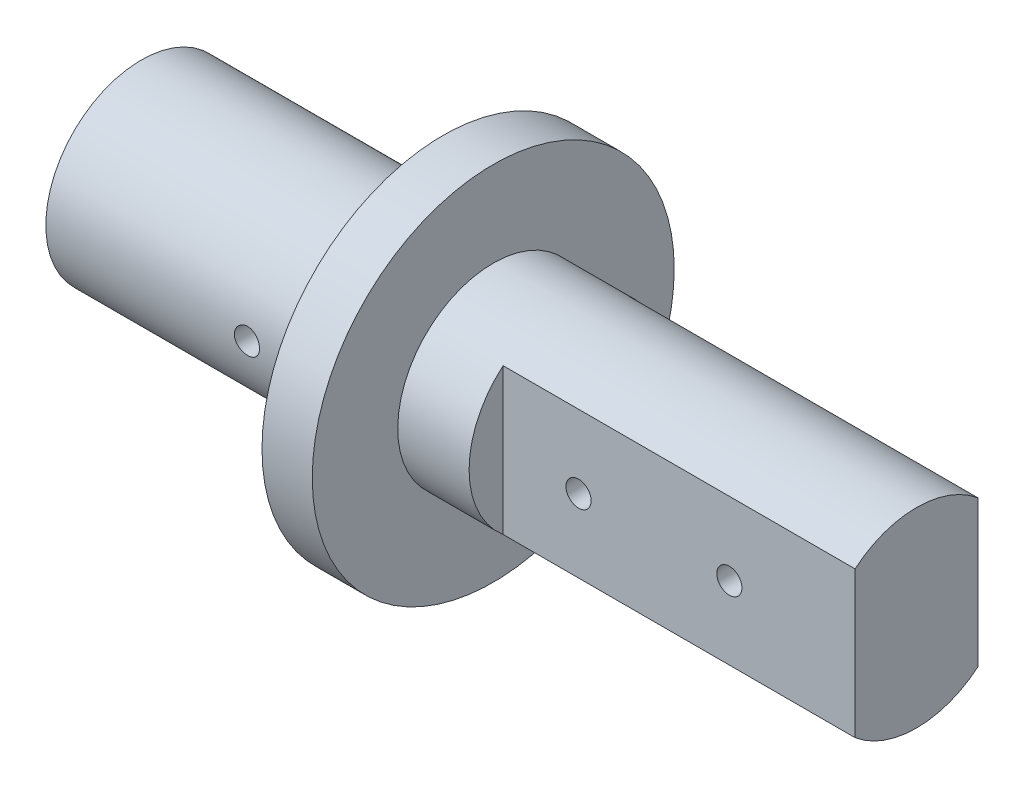
ISO-10303-21;
HEADER;
FILE_DESCRIPTION(('STEP AP214'),'2;1');
FILE_NAME('part.step','',(''),(''),'','','');
FILE_SCHEMA(('AUTOMOTIVE_DESIGN { 1 0 10303 214 1 1 1 1 }'));
ENDSEC;
DATA;
#1=APPLICATION_CONTEXT('core data for automotive mechanical design processes');
#2=APPLICATION_PROTOCOL_DEFINITION('international standard','automotive_design',2000,#1);
#3=PRODUCT_CONTEXT('',#1,'mechanical');
#4=PRODUCT('Part','Part','',(#3));
#5=PRODUCT_RELATED_PRODUCT_CATEGORY('part','',(#4));
#6=PRODUCT_DEFINITION_FORMATION('','',#4);
#7=PRODUCT_DEFINITION_CONTEXT('part definition',#1,'design');
#8=PRODUCT_DEFINITION('design','',#6,#7);
#9=PRODUCT_DEFINITION_SHAPE('','',#8);
#10=(LENGTH_UNIT() NAMED_UNIT(*) SI_UNIT(.MILLI.,.METRE.));
#11=(NAMED_UNIT(*) PLANE_ANGLE_UNIT() SI_UNIT($,.RADIAN.));
#12=(NAMED_UNIT(*) SI_UNIT($,.STERADIAN.) SOLID_ANGLE_UNIT());
#13=UNCERTAINTY_MEASURE_WITH_UNIT(LENGTH_MEASURE(1.E-05),#10,'distance_accuracy_value','');
#14=(GEOMETRIC_REPRESENTATION_CONTEXT(3) GLOBAL_UNCERTAINTY_ASSIGNED_CONTEXT((#13)) GLOBAL_UNIT_ASSIGNED_CONTEXT((#10,
#11,#12)) REPRESENTATION_CONTEXT('',''));
#15=CARTESIAN_POINT('',(0.,0.,0.));
#16=DIRECTION('',(0.,0.,1.));
#17=DIRECTION('',(1.,0.,0.));
#18=AXIS2_PLACEMENT_3D('',#15,#16,#17);
#19=CARTESIAN_POINT('',(0.,0.,0.));
#20=DIRECTION('',(-1.,0.,0.));
#21=DIRECTION('',(0.,0.,1.));
#22=AXIS2_PLACEMENT_3D('',#19,#20,#21);
#23=CYLINDRICAL_SURFACE('',#22,9.5);
#24=CARTESIAN_POINT('',(18.7571862711397,-0.133843323913922,9.49905710924214));
#25=CARTESIAN_POINT('',(18.7497191225898,-0.0644792715354372,9.50003343309708));
#26=CARTESIAN_POINT('',(18.7480669160832,0.00556405323647919,9.50025344602568));
#27=CARTESIAN_POINT('',(18.7564698736311,0.144979561522329,9.4991501404317));
#28=CARTESIAN_POINT('',(18.766536582819,0.214351015191011,9.49782529996253));
#29=CARTESIAN_POINT('',(18.7980796029942,0.350366331225342,9.49378059106666));
#30=CARTESIAN_POINT('',(18.8195490331772,0.417011812445685,9.49106156397555));
#31=CARTESIAN_POINT('',(18.8732622691699,0.545734422655254,9.48453117210074));
#32=CARTESIAN_POINT('',(18.9055043688729,0.607812273138289,9.48071998030071));
#33=CARTESIAN_POINT('',(18.980012367083,0.725964552348348,9.47240745265404));
#34=CARTESIAN_POINT('',(19.0223221240447,0.782011109915849,9.46790312848224));
#35=CARTESIAN_POINT('',(19.1157064001351,0.886240137139336,9.45871669072787));
#36=CARTESIAN_POINT('',(19.1667815153281,0.934422071547889,9.45403456507126));
#37=CARTESIAN_POINT('',(19.276627488953,1.02185619495898,9.44498592507392));
#38=CARTESIAN_POINT('',(19.3354441844691,1.06105105031087,9.44062155209812));
#39=CARTESIAN_POINT('',(19.4588782560648,1.12900411397511,9.43273687670716));
#40=CARTESIAN_POINT('',(19.5234955036514,1.15776255340239,9.42921655560101));
#41=CARTESIAN_POINT('',(19.6564987756165,1.20392977740594,9.42343337261771));
#42=CARTESIAN_POINT('',(19.7248727157887,1.22137287959152,9.4211667117012));
#43=CARTESIAN_POINT('',(19.8636103529643,1.24452529660299,9.41813651838227));
#44=CARTESIAN_POINT('',(19.9339739399041,1.25023525920218,9.41737290299852));
#45=CARTESIAN_POINT('',(20.0741180473625,1.2497517017472,9.41743702976489));
#46=CARTESIAN_POINT('',(20.1438989048636,1.24364904358161,9.41825262474987));
#47=CARTESIAN_POINT('',(20.2814336529233,1.21990371925658,9.42135745067241));
#48=CARTESIAN_POINT('',(20.3491875416964,1.20226104293217,9.42364668290801));
#49=CARTESIAN_POINT('',(20.480743116948,1.15596182651778,9.42943754488172));
#50=CARTESIAN_POINT('',(20.5445458358198,1.12730817768202,9.43293885632892));
#51=CARTESIAN_POINT('',(20.6664552359945,1.05980782384128,9.44076039951871));
#52=CARTESIAN_POINT('',(20.7245616357526,1.02096061536062,9.4450806717081));
#53=CARTESIAN_POINT('',(20.8338984806609,0.933828974038488,9.45409385220929));
#54=CARTESIAN_POINT('',(20.885073778255,0.885475593717308,9.45878932455992));
#55=CARTESIAN_POINT('',(20.9786065215152,0.780866430075416,9.4679986824394));
#56=CARTESIAN_POINT('',(21.0209637465793,0.724610449113877,9.47251256342309));
#57=CARTESIAN_POINT('',(21.0958030235709,0.605539355360445,9.48086976017443));
#58=CARTESIAN_POINT('',(21.1282487731954,0.542701236249752,9.48471058940574));
#59=CARTESIAN_POINT('',(21.1821115457805,0.412408807957424,9.49126803634612));
#60=CARTESIAN_POINT('',(21.203529026196,0.344954690379857,9.49398470068487));
#61=CARTESIAN_POINT('',(21.2346061809182,0.207763032854201,9.49797421108078));
#62=CARTESIAN_POINT('',(21.2443337745644,0.138041124441231,9.4992553944454));
#63=CARTESIAN_POINT('',(21.2519651241998,-0.00205653685352284,9.50025797279816));
#64=CARTESIAN_POINT('',(21.249869366228,-0.0724322627391881,9.49997943190406));
#65=CARTESIAN_POINT('',(21.2339681065827,-0.211383856020531,9.49790067530691));
#66=CARTESIAN_POINT('',(21.2202346292857,-0.279968125199801,9.49610981936629));
#67=CARTESIAN_POINT('',(21.1815597652179,-0.413850068958151,9.49121796297753));
#68=CARTESIAN_POINT('',(21.1566181539444,-0.479147677675186,9.48811693628631));
#69=CARTESIAN_POINT('',(21.096156312494,-0.604829835387539,9.48093661981255));
#70=CARTESIAN_POINT('',(21.0606043437987,-0.665198941952211,9.47685440224967));
#71=CARTESIAN_POINT('',(20.9799543620407,-0.779141796266092,9.46816815868444));
#72=CARTESIAN_POINT('',(20.9348558578671,-0.832715194190853,9.46356410584252));
#73=CARTESIAN_POINT('',(20.8359870238673,-0.931970546159648,9.45430798542196));
#74=CARTESIAN_POINT('',(20.7821536989094,-0.9775897640859,9.44965581802707));
#75=CARTESIAN_POINT('',(20.6675606826757,-1.05915474905901,9.44086222125012));
#76=CARTESIAN_POINT('',(20.6068009758146,-1.09510049433848,9.43672079301734));
#77=CARTESIAN_POINT('',(20.4800260933277,-1.15630060773529,9.42941800330284));
#78=CARTESIAN_POINT('',(20.4140086301521,-1.18155029167616,9.42625707137639));
#79=CARTESIAN_POINT('',(20.2786196091799,-1.22058753162685,9.42128212839032));
#80=CARTESIAN_POINT('',(20.2092482258022,-1.23437568301045,9.41946804736853));
#81=CARTESIAN_POINT('',(20.0696770146042,-1.25001578901799,9.41740533972257));
#82=CARTESIAN_POINT('',(19.9994872830052,-1.25195636866387,9.41714509008395));
#83=CARTESIAN_POINT('',(19.8597839001592,-1.24407956860155,9.4181888493365));
#84=CARTESIAN_POINT('',(19.7902702339264,-1.23426245012179,9.41949282347429));
#85=CARTESIAN_POINT('',(19.6541538459982,-1.20322302888803,9.42350758955671));
#86=CARTESIAN_POINT('',(19.587541324056,-1.1820429706235,9.42621316941837));
#87=CARTESIAN_POINT('',(19.4588147107473,-1.12892288538793,9.43272202907677));
#88=CARTESIAN_POINT('',(19.3967006531188,-1.09698277772767,9.43652531710514));
#89=CARTESIAN_POINT('',(19.2783359388641,-1.02303423463727,9.4448286559659));
#90=CARTESIAN_POINT('',(19.2221213242369,-0.980968558751438,9.4493326146031));
#91=CARTESIAN_POINT('',(19.1175063990004,-0.888032217775664,9.45851856141931));
#92=CARTESIAN_POINT('',(19.0691080485902,-0.837159350584597,9.46320059389391));
#93=CARTESIAN_POINT('',(18.9811880300445,-0.72765848566234,9.47225147965771));
#94=CARTESIAN_POINT('',(18.9417281493417,-0.668980707507695,9.47661801890231));
#95=CARTESIAN_POINT('',(18.8732619564631,-0.545816303637497,9.48450716558606));
#96=CARTESIAN_POINT('',(18.8442446968534,-0.481335850307806,9.48803065552202));
#97=CARTESIAN_POINT('',(18.804886095254,-0.369491516358376,9.49292106017614));
#98=CARTESIAN_POINT('',(18.7915404773749,-0.323175076086507,9.49461755714822));
#99=CARTESIAN_POINT('',(18.7702681725671,-0.229294778749665,9.49734856170854));
#100=CARTESIAN_POINT('',(18.762341446779,-0.181730930632482,9.49838307404391));
#101=CARTESIAN_POINT('',(18.7571862711397,-0.133843323913922,9.49905710924214));
#102=B_SPLINE_CURVE_WITH_KNOTS('',3,(#24,#25,#26,#27,#28,#29,#30,#31,#32,#33,#34,#35,#36,#37,
#38,#39,#40,#41,#42,#43,#44,#45,#46,#47,#48,#49,#50,#51,#52,#53,#54,#55,#56,#57,#58,#59,#60,#61,
#62,#63,#64,#65,#66,#67,#68,#69,#70,#71,#72,#73,#74,#75,#76,#77,#78,#79,#80,#81,#82,#83,#84,#85,
#86,#87,#88,#89,#90,#91,#92,#93,#94,#95,#96,#97,#98,#99,#100,#101),.UNSPECIFIED.,.T.,.F.,(4,2,2,
2,2,2,2,2,2,2,2,2,2,2,2,2,2,2,2,2,2,2,2,2,2,2,2,2,2,2,2,2,2,2,2,2,2,2,4),(0.,0.209139655009107,
0.418485522785862,0.627705207165943,0.836891772359222,1.04700687661839,1.25713627485178,
1.4685710582632,1.68000115915521,1.8907869907077,2.10156118470126,2.31072055855557,
2.51988011664733,2.72898479124065,2.93809979578234,3.14879151172392,3.35948849791804,
3.57094818879147,3.78239910756716,3.9926154431566,4.20282313715398,4.41173930435003,
4.62065965639331,4.83021131987617,5.03977376613028,5.25092086306614,5.46206843512397,
5.67330838067465,5.88453735259802,6.09418428390281,6.30382655743177,6.51269478176198,
6.721564572422,6.93164405516653,7.14177614108067,7.35331922359407,7.56463988619237,
7.70902691413943,7.85341290666598),.UNSPECIFIED.);
#103=CARTESIAN_POINT('',(18.7571862711397,-0.133843323913922,9.49905710924214));
#104=VERTEX_POINT('',#103);
#105=EDGE_CURVE('E12',#104,#104,#102,.T.);
#106=ORIENTED_EDGE('',*,*,#105,.T.);
#107=EDGE_LOOP('',(#106));
#108=FACE_BOUND('',#107,.T.);
#109=CARTESIAN_POINT('',(0.,0.,0.));
#110=DIRECTION('',(1.,0.,0.));
#111=DIRECTION('',(0.,0.,-1.));
#112=AXIS2_PLACEMENT_3D('',#109,#110,#111);
#113=CIRCLE('',#112,9.5);
#114=CARTESIAN_POINT('',(0.,0.,-9.5));
#115=VERTEX_POINT('',#114);
#116=EDGE_CURVE('E173',#115,#115,#113,.F.);
#117=ORIENTED_EDGE('',*,*,#116,.F.);
#118=EDGE_LOOP('',(#117));
#119=FACE_BOUND('',#118,.T.);
#120=CARTESIAN_POINT('',(30.,0.,0.));
#121=DIRECTION('',(1.,0.,0.));
#122=DIRECTION('',(0.,0.,-1.));
#123=AXIS2_PLACEMENT_3D('',#120,#121,#122);
#124=CIRCLE('',#123,9.5);
#125=CARTESIAN_POINT('',(30.,0.,-9.5));
#126=VERTEX_POINT('',#125);
#127=EDGE_CURVE('E50',#126,#126,#124,.T.);
#128=ORIENTED_EDGE('',*,*,#127,.F.);
#129=EDGE_LOOP('',(#128));
#130=FACE_BOUND('',#129,.T.);
#131=ADVANCED_FACE('F46',(#108,#119,#130),#23,.T.);
#132=CARTESIAN_POINT('',(0.,0.,0.));
#133=DIRECTION('',(1.,0.,0.));
#134=DIRECTION('',(0.,0.,-1.));
#135=AXIS2_PLACEMENT_3D('',#132,#133,#134);
#136=PLANE('',#135);
#137=ORIENTED_EDGE('',*,*,#116,.T.);
#138=EDGE_LOOP('',(#137));
#139=FACE_BOUND('',#138,.T.);
#140=ADVANCED_FACE('F209',(#139),#136,.F.);
#141=CARTESIAN_POINT('',(30.,0.,0.));
#142=DIRECTION('',(1.,0.,0.));
#143=DIRECTION('',(0.,0.,-1.));
#144=AXIS2_PLACEMENT_3D('',#141,#142,#143);
#145=CYLINDRICAL_SURFACE('',#144,18.);
#146=CARTESIAN_POINT('',(30.,0.,0.));
#147=DIRECTION('',(1.,0.,0.));
#148=DIRECTION('',(0.,0.,-1.));
#149=AXIS2_PLACEMENT_3D('',#146,#147,#148);
#150=CIRCLE('',#149,18.);
#151=CARTESIAN_POINT('',(30.,0.,-18.));
#152=VERTEX_POINT('',#151);
#153=EDGE_CURVE('E137',#152,#152,#150,.T.);
#154=ORIENTED_EDGE('',*,*,#153,.T.);
#155=EDGE_LOOP('',(#154));
#156=FACE_BOUND('',#155,.T.);
#157=CARTESIAN_POINT('',(35.,0.,0.));
#158=DIRECTION('',(1.,0.,0.));
#159=DIRECTION('',(0.,0.,-1.));
#160=AXIS2_PLACEMENT_3D('',#157,#158,#159);
#161=CIRCLE('',#160,18.);
#162=CARTESIAN_POINT('',(35.,0.,-18.));
#163=VERTEX_POINT('',#162);
#164=EDGE_CURVE('E136',#163,#163,#161,.T.);
#165=ORIENTED_EDGE('',*,*,#164,.F.);
#166=EDGE_LOOP('',(#165));
#167=FACE_BOUND('',#166,.T.);
#168=ADVANCED_FACE('F201',(#156,#167),#145,.T.);
#169=CARTESIAN_POINT('',(30.,0.,0.));
#170=DIRECTION('',(1.,0.,0.));
#171=DIRECTION('',(0.,0.,-1.));
#172=AXIS2_PLACEMENT_3D('',#169,#170,#171);
#173=PLANE('',#172);
#174=ORIENTED_EDGE('',*,*,#127,.T.);
#175=EDGE_LOOP('',(#174));
#176=FACE_BOUND('',#175,.T.);
#177=ORIENTED_EDGE('',*,*,#153,.F.);
#178=EDGE_LOOP('',(#177));
#179=FACE_BOUND('',#178,.T.);
#180=ADVANCED_FACE('F197',(#176,#179),#173,.F.);
#181=CARTESIAN_POINT('',(35.,0.,0.));
#182=DIRECTION('',(1.,0.,0.));
#183=DIRECTION('',(0.,0.,-1.));
#184=AXIS2_PLACEMENT_3D('',#181,#182,#183);
#185=PLANE('',#184);
#186=CARTESIAN_POINT('',(35.,0.,0.));
#187=DIRECTION('',(1.,0.,0.));
#188=DIRECTION('',(0.,0.,-1.));
#189=AXIS2_PLACEMENT_3D('',#186,#187,#188);
#190=CIRCLE('',#189,9.5);
#191=CARTESIAN_POINT('',(35.,0.,-9.5));
#192=VERTEX_POINT('',#191);
#193=EDGE_CURVE('E140',#192,#192,#190,.T.);
#194=ORIENTED_EDGE('',*,*,#193,.F.);
#195=EDGE_LOOP('',(#194));
#196=FACE_BOUND('',#195,.T.);
#197=ORIENTED_EDGE('',*,*,#164,.T.);
#198=EDGE_LOOP('',(#197));
#199=FACE_BOUND('',#198,.T.);
#200=ADVANCED_FACE('F200',(#196,#199),#185,.T.);
#201=CARTESIAN_POINT('',(42.1,10.,0.));
#202=DIRECTION('',(-1.,0.,0.));
#203=DIRECTION('',(0.,0.,1.));
#204=AXIS2_PLACEMENT_3D('',#201,#202,#203);
#205=PLANE('',#204);
#206=DIRECTION('',(0.,1.,0.));
#207=VECTOR('',#206,1.);
#208=CARTESIAN_POINT('',(42.1,10.,-6.11437827766147));
#209=LINE('',#208,#207);
#210=CARTESIAN_POINT('',(42.1,-7.27078938476845,-6.11437827766147));
#211=VERTEX_POINT('',#210);
#212=CARTESIAN_POINT('',(42.1,7.27078938476845,-6.11437827766147));
#213=VERTEX_POINT('',#212);
#214=EDGE_CURVE('E158',#211,#213,#209,.T.);
#215=ORIENTED_EDGE('',*,*,#214,.F.);
#216=CARTESIAN_POINT('',(42.1,0.,0.));
#217=DIRECTION('',(-1.,0.,0.));
#218=DIRECTION('',(0.,0.,1.));
#219=AXIS2_PLACEMENT_3D('',#216,#217,#218);
#220=CIRCLE('',#219,9.5);
#221=EDGE_CURVE('E87',#213,#211,#220,.T.);
#222=ORIENTED_EDGE('',*,*,#221,.F.);
#223=EDGE_LOOP('',(#215,#222));
#224=FACE_BOUND('',#223,.T.);
#225=ADVANCED_FACE('F205',(#224),#205,.F.);
#226=CARTESIAN_POINT('',(72.1,-7.5,-6.11437827766147));
#227=DIRECTION('',(0.,0.,1.));
#228=DIRECTION('',(1.,0.,0.));
#229=AXIS2_PLACEMENT_3D('',#226,#227,#228);
#230=PLANE('',#229);
#231=CARTESIAN_POINT('',(64.6,0.,-6.11437827766147));
#232=DIRECTION('',(0.,0.,1.));
#233=DIRECTION('',(1.,0.,0.));
#234=AXIS2_PLACEMENT_3D('',#231,#232,#233);
#235=CIRCLE('',#234,1.24999999999999);
#236=CARTESIAN_POINT('',(65.85,0.,-6.11437827766147));
#237=VERTEX_POINT('',#236);
#238=EDGE_CURVE('E125',#237,#237,#235,.F.);
#239=ORIENTED_EDGE('',*,*,#238,.F.);
#240=EDGE_LOOP('',(#239));
#241=FACE_BOUND('',#240,.T.);
#242=CARTESIAN_POINT('',(49.6,0.,-6.11437827766147));
#243=DIRECTION('',(0.,0.,1.));
#244=DIRECTION('',(1.,0.,0.));
#245=AXIS2_PLACEMENT_3D('',#242,#243,#244);
#246=CIRCLE('',#245,1.24999999999999);
#247=CARTESIAN_POINT('',(50.85,0.,-6.11437827766147));
#248=VERTEX_POINT('',#247);
#249=EDGE_CURVE('E129',#248,#248,#246,.F.);
#250=ORIENTED_EDGE('',*,*,#249,.F.);
#251=EDGE_LOOP('',(#250));
#252=FACE_BOUND('',#251,.T.);
#253=ORIENTED_EDGE('',*,*,#214,.T.);
#254=DIRECTION('',(-1.,0.,0.));
#255=VECTOR('',#254,1.);
#256=CARTESIAN_POINT('',(77.1,7.27078938476845,-6.11437827766147));
#257=LINE('',#256,#255);
#258=CARTESIAN_POINT('',(77.1,7.27078938476845,-6.11437827766147));
#259=VERTEX_POINT('',#258);
#260=EDGE_CURVE('E146',#259,#213,#257,.T.);
#261=ORIENTED_EDGE('',*,*,#260,.F.);
#262=DIRECTION('',(0.,1.,0.));
#263=VECTOR('',#262,1.);
#264=CARTESIAN_POINT('',(77.1,-7.5,-6.11437827766147));
#265=LINE('',#264,#263);
#266=CARTESIAN_POINT('',(77.1,-7.27078938476845,-6.11437827766147));
#267=VERTEX_POINT('',#266);
#268=EDGE_CURVE('E164',#267,#259,#265,.T.);
#269=ORIENTED_EDGE('',*,*,#268,.F.);
#270=DIRECTION('',(-1.,0.,0.));
#271=VECTOR('',#270,1.);
#272=CARTESIAN_POINT('',(77.1,-7.27078938476845,-6.11437827766147));
#273=LINE('',#272,#271);
#274=EDGE_CURVE('E150',#267,#211,#273,.T.);
#275=ORIENTED_EDGE('',*,*,#274,.T.);
#276=EDGE_LOOP('',(#253,#261,#269,#275));
#277=FACE_BOUND('',#276,.T.);
#278=ADVANCED_FACE('F246',(#241,#252,#277),#230,.F.);
#279=CARTESIAN_POINT('',(72.1,-7.5,6.11437827766147));
#280=DIRECTION('',(0.,0.,-1.));
#281=DIRECTION('',(-1.,0.,0.));
#282=AXIS2_PLACEMENT_3D('',#279,#280,#281);
#283=PLANE('',#282);
#284=CARTESIAN_POINT('',(49.6,0.,6.11437827766147));
#285=DIRECTION('',(0.,0.,-1.));
#286=DIRECTION('',(-1.,0.,0.));
#287=AXIS2_PLACEMENT_3D('',#284,#285,#286);
#288=CIRCLE('',#287,1.24999999999999);
#289=CARTESIAN_POINT('',(48.35,0.,6.11437827766147));
#290=VERTEX_POINT('',#289);
#291=EDGE_CURVE('E114',#290,#290,#288,.F.);
#292=ORIENTED_EDGE('',*,*,#291,.F.);
#293=EDGE_LOOP('',(#292));
#294=FACE_BOUND('',#293,.T.);
#295=CARTESIAN_POINT('',(64.6,0.,6.11437827766147));
#296=DIRECTION('',(0.,0.,-1.));
#297=DIRECTION('',(-1.,0.,0.));
#298=AXIS2_PLACEMENT_3D('',#295,#296,#297);
#299=CIRCLE('',#298,1.24999999999999);
#300=CARTESIAN_POINT('',(63.35,0.,6.11437827766147));
#301=VERTEX_POINT('',#300);
#302=EDGE_CURVE('E113',#301,#301,#299,.F.);
#303=ORIENTED_EDGE('',*,*,#302,.F.);
#304=EDGE_LOOP('',(#303));
#305=FACE_BOUND('',#304,.T.);
#306=DIRECTION('',(0.,-1.,0.));
#307=VECTOR('',#306,1.);
#308=CARTESIAN_POINT('',(42.1,10.,6.11437827766147));
#309=LINE('',#308,#307);
#310=CARTESIAN_POINT('',(42.1,7.27078938476845,6.11437827766147));
#311=VERTEX_POINT('',#310);
#312=CARTESIAN_POINT('',(42.1,-7.27078938476845,6.11437827766147));
#313=VERTEX_POINT('',#312);
#314=EDGE_CURVE('E155',#311,#313,#309,.T.);
#315=ORIENTED_EDGE('',*,*,#314,.T.);
#316=DIRECTION('',(-1.,0.,0.));
#317=VECTOR('',#316,1.);
#318=CARTESIAN_POINT('',(77.1,-7.27078938476845,6.11437827766147));
#319=LINE('',#318,#317);
#320=CARTESIAN_POINT('',(77.1,-7.27078938476845,6.11437827766147));
#321=VERTEX_POINT('',#320);
#322=EDGE_CURVE('E147',#321,#313,#319,.T.);
#323=ORIENTED_EDGE('',*,*,#322,.F.);
#324=DIRECTION('',(0.,-1.,0.));
#325=VECTOR('',#324,1.);
#326=CARTESIAN_POINT('',(77.1,-7.5,6.11437827766147));
#327=LINE('',#326,#325);
#328=CARTESIAN_POINT('',(77.1,7.27078938476845,6.11437827766147));
#329=VERTEX_POINT('',#328);
#330=EDGE_CURVE('E120',#329,#321,#327,.T.);
#331=ORIENTED_EDGE('',*,*,#330,.F.);
#332=DIRECTION('',(-1.,0.,0.));
#333=VECTOR('',#332,1.);
#334=CARTESIAN_POINT('',(77.1,7.27078938476845,6.11437827766147));
#335=LINE('',#334,#333);
#336=EDGE_CURVE('E143',#329,#311,#335,.T.);
#337=ORIENTED_EDGE('',*,*,#336,.T.);
#338=EDGE_LOOP('',(#315,#323,#331,#337));
#339=FACE_BOUND('',#338,.T.);
#340=ADVANCED_FACE('F48',(#294,#305,#339),#283,.F.);
#341=ORIENTED_EDGE('',*,*,#314,.F.);
#342=CARTESIAN_POINT('',(42.1,0.,0.));
#343=DIRECTION('',(-1.,0.,0.));
#344=DIRECTION('',(0.,0.,1.));
#345=AXIS2_PLACEMENT_3D('',#342,#343,#344);
#346=CIRCLE('',#345,9.5);
#347=EDGE_CURVE('E62',#313,#311,#346,.T.);
#348=ORIENTED_EDGE('',*,*,#347,.F.);
#349=EDGE_LOOP('',(#341,#348));
#350=FACE_BOUND('',#349,.T.);
#351=ADVANCED_FACE('F211',(#350),#205,.F.);
#352=ORIENTED_EDGE('',*,*,#193,.T.);
#353=EDGE_LOOP('',(#352));
#354=FACE_BOUND('',#353,.T.);
#355=ORIENTED_EDGE('',*,*,#347,.T.);
#356=ORIENTED_EDGE('',*,*,#336,.F.);
#357=CARTESIAN_POINT('',(77.1,0.,0.));
#358=DIRECTION('',(1.,0.,0.));
#359=DIRECTION('',(0.,0.,-1.));
#360=AXIS2_PLACEMENT_3D('',#357,#358,#359);
#361=CIRCLE('',#360,9.5);
#362=EDGE_CURVE('E161',#259,#329,#361,.T.);
#363=ORIENTED_EDGE('',*,*,#362,.F.);
#364=ORIENTED_EDGE('',*,*,#260,.T.);
#365=ORIENTED_EDGE('',*,*,#221,.T.);
#366=ORIENTED_EDGE('',*,*,#274,.F.);
#367=CARTESIAN_POINT('',(77.1,0.,0.));
#368=DIRECTION('',(1.,0.,0.));
#369=DIRECTION('',(0.,0.,-1.));
#370=AXIS2_PLACEMENT_3D('',#367,#368,#369);
#371=CIRCLE('',#370,9.5);
#372=EDGE_CURVE('E167',#321,#267,#371,.T.);
#373=ORIENTED_EDGE('',*,*,#372,.F.);
#374=ORIENTED_EDGE('',*,*,#322,.T.);
#375=EDGE_LOOP('',(#355,#356,#363,#364,#365,#366,#373,#374));
#376=FACE_BOUND('',#375,.T.);
#377=ADVANCED_FACE('F183',(#354,#376),#23,.T.);
#378=CARTESIAN_POINT('',(20.,0.,10.));
#379=DIRECTION('',(0.,0.,1.));
#380=DIRECTION('',(1.,0.,0.));
#381=AXIS2_PLACEMENT_3D('',#378,#379,#380);
#382=CYLINDRICAL_SURFACE('',#381,1.24999999999999);
#383=CARTESIAN_POINT('',(20.,0.,0.));
#384=DIRECTION('',(0.,0.,1.));
#385=DIRECTION('',(1.,0.,0.));
#386=AXIS2_PLACEMENT_3D('',#383,#384,#385);
#387=CIRCLE('',#386,1.25);
#388=CARTESIAN_POINT('',(21.25,0.,0.));
#389=VERTEX_POINT('',#388);
#390=EDGE_CURVE('E133',#389,#389,#387,.T.);
#391=ORIENTED_EDGE('',*,*,#390,.F.);
#392=EDGE_LOOP('',(#391));
#393=FACE_BOUND('',#392,.T.);
#394=ORIENTED_EDGE('',*,*,#105,.F.);
#395=EDGE_LOOP('',(#394));
#396=FACE_BOUND('',#395,.T.);
#397=ADVANCED_FACE('F186',(#393,#396),#382,.F.);
#398=CARTESIAN_POINT('',(20.,0.,0.));
#399=DIRECTION('',(0.,0.,1.));
#400=DIRECTION('',(1.,0.,0.));
#401=AXIS2_PLACEMENT_3D('',#398,#399,#400);
#402=CONICAL_SURFACE('',#401,1.25,1.02974425867665);
#403=CARTESIAN_POINT('',(20.,0.,-0.751075773784452));
#404=VERTEX_POINT('',#403);
#405=VERTEX_LOOP('',#404);
#406=FACE_BOUND('',#405,.T.);
#407=ORIENTED_EDGE('',*,*,#390,.T.);
#408=EDGE_LOOP('',(#407));
#409=FACE_BOUND('',#408,.T.);
#410=ADVANCED_FACE('F191',(#406,#409),#402,.F.);
#411=CARTESIAN_POINT('',(49.6,0.,-1.61437827766148));
#412=DIRECTION('',(0.,0.,-1.));
#413=DIRECTION('',(-1.,0.,0.));
#414=AXIS2_PLACEMENT_3D('',#411,#412,#413);
#415=CONICAL_SURFACE('',#414,1.25,1.02974425867665);
#416=CARTESIAN_POINT('',(49.6,0.,-0.863302503877024));
#417=VERTEX_POINT('',#416);
#418=VERTEX_LOOP('',#417);
#419=FACE_BOUND('',#418,.T.);
#420=CARTESIAN_POINT('',(49.6,0.,-1.61437827766148));
#421=DIRECTION('',(0.,0.,-1.));
#422=DIRECTION('',(-1.,0.,0.));
#423=AXIS2_PLACEMENT_3D('',#420,#421,#422);
#424=CIRCLE('',#423,1.25);
#425=CARTESIAN_POINT('',(48.35,0.,-1.61437827766148));
#426=VERTEX_POINT('',#425);
#427=EDGE_CURVE('E130',#426,#426,#424,.T.);
#428=ORIENTED_EDGE('',*,*,#427,.T.);
#429=EDGE_LOOP('',(#428));
#430=FACE_BOUND('',#429,.T.);
#431=ADVANCED_FACE('F193',(#419,#430),#415,.F.);
#432=CARTESIAN_POINT('',(49.6,0.,-6.61437827766147));
#433=DIRECTION('',(0.,0.,-1.));
#434=DIRECTION('',(-1.,0.,0.));
#435=AXIS2_PLACEMENT_3D('',#432,#433,#434);
#436=CYLINDRICAL_SURFACE('',#435,1.24999999999999);
#437=ORIENTED_EDGE('',*,*,#427,.F.);
#438=EDGE_LOOP('',(#437));
#439=FACE_BOUND('',#438,.T.);
#440=ORIENTED_EDGE('',*,*,#249,.T.);
#441=EDGE_LOOP('',(#440));
#442=FACE_BOUND('',#441,.T.);
#443=ADVANCED_FACE('F260',(#439,#442),#436,.F.);
#444=CARTESIAN_POINT('',(64.6,0.,-1.61437827766148));
#445=DIRECTION('',(0.,0.,-1.));
#446=DIRECTION('',(-1.,0.,0.));
#447=AXIS2_PLACEMENT_3D('',#444,#445,#446);
#448=CONICAL_SURFACE('',#447,1.25,1.02974425867665);
#449=CARTESIAN_POINT('',(64.6,0.,-0.863302503877024));
#450=VERTEX_POINT('',#449);
#451=VERTEX_LOOP('',#450);
#452=FACE_BOUND('',#451,.T.);
#453=CARTESIAN_POINT('',(64.6,0.,-1.61437827766148));
#454=DIRECTION('',(0.,0.,-1.));
#455=DIRECTION('',(-1.,0.,0.));
#456=AXIS2_PLACEMENT_3D('',#453,#454,#455);
#457=CIRCLE('',#456,1.25);
#458=CARTESIAN_POINT('',(63.35,0.,-1.61437827766148));
#459=VERTEX_POINT('',#458);
#460=EDGE_CURVE('E126',#459,#459,#457,.T.);
#461=ORIENTED_EDGE('',*,*,#460,.T.);
#462=EDGE_LOOP('',(#461));
#463=FACE_BOUND('',#462,.T.);
#464=ADVANCED_FACE('F262',(#452,#463),#448,.F.);
#465=CARTESIAN_POINT('',(64.6,0.,-6.61437827766147));
#466=DIRECTION('',(0.,0.,-1.));
#467=DIRECTION('',(-1.,0.,0.));
#468=AXIS2_PLACEMENT_3D('',#465,#466,#467);
#469=CYLINDRICAL_SURFACE('',#468,1.24999999999999);
#470=ORIENTED_EDGE('',*,*,#460,.F.);
#471=EDGE_LOOP('',(#470));
#472=FACE_BOUND('',#471,.T.);
#473=ORIENTED_EDGE('',*,*,#238,.T.);
#474=EDGE_LOOP('',(#473));
#475=FACE_BOUND('',#474,.T.);
#476=ADVANCED_FACE('F268',(#472,#475),#469,.F.);
#477=CARTESIAN_POINT('',(64.6,0.,1.61437827766148));
#478=DIRECTION('',(0.,0.,1.));
#479=DIRECTION('',(1.,0.,0.));
#480=AXIS2_PLACEMENT_3D('',#477,#478,#479);
#481=CONICAL_SURFACE('',#480,1.25,1.02974425867665);
#482=CARTESIAN_POINT('',(64.6,0.,0.863302503877024));
#483=VERTEX_POINT('',#482);
#484=VERTEX_LOOP('',#483);
#485=FACE_BOUND('',#484,.T.);
#486=CARTESIAN_POINT('',(64.6,0.,1.61437827766148));
#487=DIRECTION('',(0.,0.,1.));
#488=DIRECTION('',(1.,0.,0.));
#489=AXIS2_PLACEMENT_3D('',#486,#487,#488);
#490=CIRCLE('',#489,1.25);
#491=CARTESIAN_POINT('',(65.85,0.,1.61437827766148));
#492=VERTEX_POINT('',#491);
#493=EDGE_CURVE('E117',#492,#492,#490,.T.);
#494=ORIENTED_EDGE('',*,*,#493,.T.);
#495=EDGE_LOOP('',(#494));
#496=FACE_BOUND('',#495,.T.);
#497=ADVANCED_FACE('F275',(#485,#496),#481,.F.);
#498=CARTESIAN_POINT('',(64.6,0.,6.61437827766147));
#499=DIRECTION('',(0.,0.,1.));
#500=DIRECTION('',(1.,0.,0.));
#501=AXIS2_PLACEMENT_3D('',#498,#499,#500);
#502=CYLINDRICAL_SURFACE('',#501,1.24999999999999);
#503=ORIENTED_EDGE('',*,*,#493,.F.);
#504=EDGE_LOOP('',(#503));
#505=FACE_BOUND('',#504,.T.);
#506=ORIENTED_EDGE('',*,*,#302,.T.);
#507=EDGE_LOOP('',(#506));
#508=FACE_BOUND('',#507,.T.);
#509=ADVANCED_FACE('F107',(#505,#508),#502,.F.);
#510=CARTESIAN_POINT('',(49.6,0.,1.61437827766148));
#511=DIRECTION('',(0.,0.,1.));
#512=DIRECTION('',(1.,0.,0.));
#513=AXIS2_PLACEMENT_3D('',#510,#511,#512);
#514=CONICAL_SURFACE('',#513,1.25,1.02974425867665);
#515=CARTESIAN_POINT('',(49.6,0.,0.863302503877024));
#516=VERTEX_POINT('',#515);
#517=VERTEX_LOOP('',#516);
#518=FACE_BOUND('',#517,.T.);
#519=CARTESIAN_POINT('',(49.6,0.,1.61437827766148));
#520=DIRECTION('',(0.,0.,1.));
#521=DIRECTION('',(1.,0.,0.));
#522=AXIS2_PLACEMENT_3D('',#519,#520,#521);
#523=CIRCLE('',#522,1.25);
#524=CARTESIAN_POINT('',(50.85,0.,1.61437827766148));
#525=VERTEX_POINT('',#524);
#526=EDGE_CURVE('E111',#525,#525,#523,.T.);
#527=ORIENTED_EDGE('',*,*,#526,.T.);
#528=EDGE_LOOP('',(#527));
#529=FACE_BOUND('',#528,.T.);
#530=ADVANCED_FACE('F103',(#518,#529),#514,.F.);
#531=CARTESIAN_POINT('',(49.6,0.,6.61437827766147));
#532=DIRECTION('',(0.,0.,1.));
#533=DIRECTION('',(1.,0.,0.));
#534=AXIS2_PLACEMENT_3D('',#531,#532,#533);
#535=CYLINDRICAL_SURFACE('',#534,1.24999999999999);
#536=ORIENTED_EDGE('',*,*,#526,.F.);
#537=EDGE_LOOP('',(#536));
#538=FACE_BOUND('',#537,.T.);
#539=ORIENTED_EDGE('',*,*,#291,.T.);
#540=EDGE_LOOP('',(#539));
#541=FACE_BOUND('',#540,.T.);
#542=ADVANCED_FACE('F106',(#538,#541),#535,.F.);
#543=CARTESIAN_POINT('',(77.1,0.,0.));
#544=DIRECTION('',(1.,0.,0.));
#545=DIRECTION('',(0.,0.,-1.));
#546=AXIS2_PLACEMENT_3D('',#543,#544,#545);
#547=PLANE('',#546);
#548=ORIENTED_EDGE('',*,*,#372,.T.);
#549=ORIENTED_EDGE('',*,*,#268,.T.);
#550=ORIENTED_EDGE('',*,*,#362,.T.);
#551=ORIENTED_EDGE('',*,*,#330,.T.);
#552=EDGE_LOOP('',(#548,#549,#550,#551));
#553=FACE_BOUND('',#552,.T.);
#554=ADVANCED_FACE('F243',(#553),#547,.T.);
#555=CLOSED_SHELL('',(#131,#140,#168,#180,#200,#225,#278,#340,#351,#377,#397,#410,#431,#443,
#464,#476,#497,#509,#530,#542,#554));
#556=MANIFOLD_SOLID_BREP('B2',#555);
#557=ADVANCED_BREP_SHAPE_REPRESENTATION('',(#18,#556),#14);
#558=SHAPE_DEFINITION_REPRESENTATION(#9,#557);
ENDSEC;
END-ISO-10303-21;
